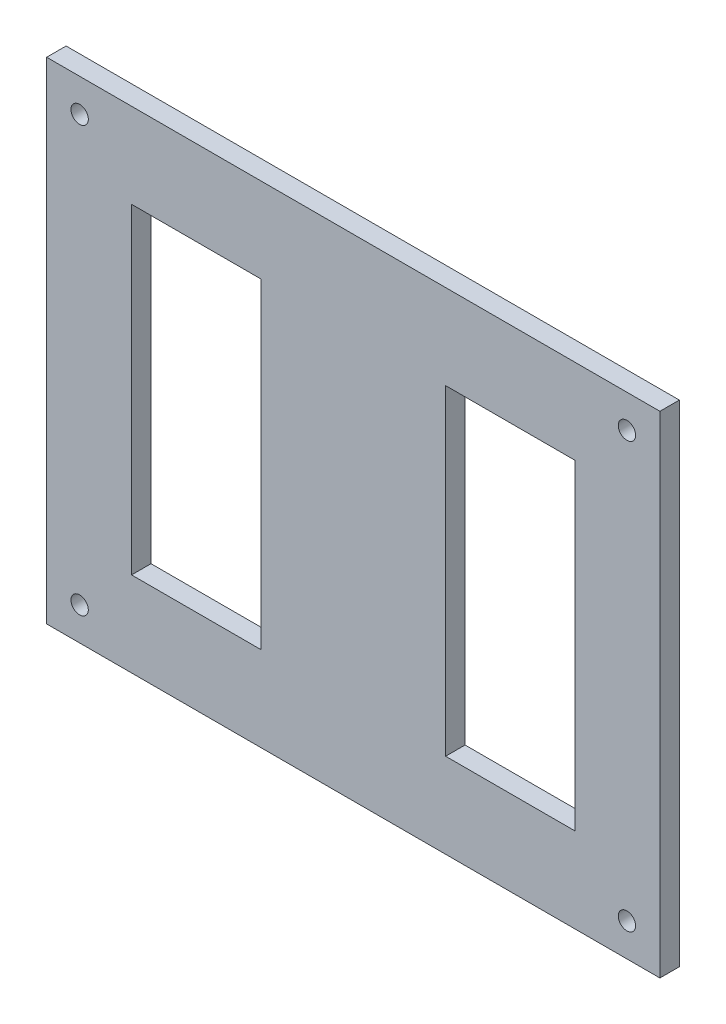
ISO-10303-21;
HEADER;
FILE_DESCRIPTION(('STEP AP214'),'2;1');
FILE_NAME('part.step','',(''),(''),'','','');
FILE_SCHEMA(('AUTOMOTIVE_DESIGN { 1 0 10303 214 1 1 1 1 }'));
ENDSEC;
DATA;
#1=APPLICATION_CONTEXT('core data for automotive mechanical design processes');
#2=APPLICATION_PROTOCOL_DEFINITION('international standard','automotive_design',2000,#1);
#3=PRODUCT_CONTEXT('',#1,'mechanical');
#4=PRODUCT('Part','Part','',(#3));
#5=PRODUCT_RELATED_PRODUCT_CATEGORY('part','',(#4));
#6=PRODUCT_DEFINITION_FORMATION('','',#4);
#7=PRODUCT_DEFINITION_CONTEXT('part definition',#1,'design');
#8=PRODUCT_DEFINITION('design','',#6,#7);
#9=PRODUCT_DEFINITION_SHAPE('','',#8);
#10=(LENGTH_UNIT() NAMED_UNIT(*) SI_UNIT(.MILLI.,.METRE.));
#11=(NAMED_UNIT(*) PLANE_ANGLE_UNIT() SI_UNIT($,.RADIAN.));
#12=(NAMED_UNIT(*) SI_UNIT($,.STERADIAN.) SOLID_ANGLE_UNIT());
#13=UNCERTAINTY_MEASURE_WITH_UNIT(LENGTH_MEASURE(1.E-05),#10,'distance_accuracy_value','');
#14=(GEOMETRIC_REPRESENTATION_CONTEXT(3) GLOBAL_UNCERTAINTY_ASSIGNED_CONTEXT((#13)) GLOBAL_UNIT_ASSIGNED_CONTEXT((#10,
#11,#12)) REPRESENTATION_CONTEXT('',''));
#15=CARTESIAN_POINT('',(0.,0.,0.));
#16=DIRECTION('',(0.,0.,1.));
#17=DIRECTION('',(1.,0.,0.));
#18=AXIS2_PLACEMENT_3D('',#15,#16,#17);
#19=CARTESIAN_POINT('',(0.,0.,3.175));
#20=DIRECTION('',(0.,0.,1.));
#21=DIRECTION('',(1.,0.,0.));
#22=AXIS2_PLACEMENT_3D('',#19,#20,#21);
#23=PLANE('',#22);
#24=DIRECTION('',(0.,1.,0.));
#25=VECTOR('',#24,1.);
#26=CARTESIAN_POINT('',(36.215,-26.215,3.175));
#27=LINE('',#26,#25);
#28=CARTESIAN_POINT('',(36.215,-26.215,3.175));
#29=VERTEX_POINT('',#28);
#30=CARTESIAN_POINT('',(36.215,26.215,3.175));
#31=VERTEX_POINT('',#30);
#32=EDGE_CURVE('E51',#29,#31,#27,.T.);
#33=ORIENTED_EDGE('',*,*,#32,.F.);
#34=DIRECTION('',(-1.,0.,0.));
#35=VECTOR('',#34,1.);
#36=CARTESIAN_POINT('',(36.215,-26.215,3.175));
#37=LINE('',#36,#35);
#38=CARTESIAN_POINT('',(15.085,-26.215,3.175));
#39=VERTEX_POINT('',#38);
#40=EDGE_CURVE('E148',#29,#39,#37,.T.);
#41=ORIENTED_EDGE('',*,*,#40,.T.);
#42=DIRECTION('',(0.,1.,0.));
#43=VECTOR('',#42,1.);
#44=CARTESIAN_POINT('',(15.085,-26.215,3.175));
#45=LINE('',#44,#43);
#46=CARTESIAN_POINT('',(15.085,26.215,3.175));
#47=VERTEX_POINT('',#46);
#48=EDGE_CURVE('E132',#39,#47,#45,.T.);
#49=ORIENTED_EDGE('',*,*,#48,.T.);
#50=DIRECTION('',(-1.,0.,0.));
#51=VECTOR('',#50,1.);
#52=CARTESIAN_POINT('',(36.215,26.215,3.175));
#53=LINE('',#52,#51);
#54=EDGE_CURVE('E142',#31,#47,#53,.T.);
#55=ORIENTED_EDGE('',*,*,#54,.F.);
#56=EDGE_LOOP('',(#33,#41,#49,#55));
#57=FACE_BOUND('',#56,.T.);
#58=CARTESIAN_POINT('',(-44.6966991411009,-34.6966991411009,3.175));
#59=DIRECTION('',(0.,0.,1.));
#60=DIRECTION('',(-1.,0.,0.));
#61=AXIS2_PLACEMENT_3D('',#58,#59,#60);
#62=CIRCLE('',#61,1.415);
#63=CARTESIAN_POINT('',(-46.1116991411009,-34.6966991411009,3.175));
#64=VERTEX_POINT('',#63);
#65=EDGE_CURVE('E155',#64,#64,#62,.T.);
#66=ORIENTED_EDGE('',*,*,#65,.F.);
#67=EDGE_LOOP('',(#66));
#68=FACE_BOUND('',#67,.T.);
#69=CARTESIAN_POINT('',(44.6966991411009,-34.6966991411009,3.175));
#70=DIRECTION('',(0.,0.,1.));
#71=DIRECTION('',(1.,0.,0.));
#72=AXIS2_PLACEMENT_3D('',#69,#70,#71);
#73=CIRCLE('',#72,1.415);
#74=CARTESIAN_POINT('',(46.1116991411009,-34.6966991411009,3.175));
#75=VERTEX_POINT('',#74);
#76=EDGE_CURVE('E186',#75,#75,#73,.T.);
#77=ORIENTED_EDGE('',*,*,#76,.F.);
#78=EDGE_LOOP('',(#77));
#79=FACE_BOUND('',#78,.T.);
#80=CARTESIAN_POINT('',(44.6966991411009,34.6966991411009,3.175));
#81=DIRECTION('',(0.,0.,1.));
#82=DIRECTION('',(-1.,0.,0.));
#83=AXIS2_PLACEMENT_3D('',#80,#81,#82);
#84=CIRCLE('',#83,1.415);
#85=CARTESIAN_POINT('',(43.2816991411009,34.6966991411009,3.175));
#86=VERTEX_POINT('',#85);
#87=EDGE_CURVE('E180',#86,#86,#84,.T.);
#88=ORIENTED_EDGE('',*,*,#87,.F.);
#89=EDGE_LOOP('',(#88));
#90=FACE_BOUND('',#89,.T.);
#91=CARTESIAN_POINT('',(-44.6966991411009,34.6966991411009,3.175));
#92=DIRECTION('',(0.,0.,1.));
#93=DIRECTION('',(1.,0.,0.));
#94=AXIS2_PLACEMENT_3D('',#91,#92,#93);
#95=CIRCLE('',#94,1.415);
#96=CARTESIAN_POINT('',(-43.2816991411009,34.6966991411009,3.175));
#97=VERTEX_POINT('',#96);
#98=EDGE_CURVE('E179',#97,#97,#95,.T.);
#99=ORIENTED_EDGE('',*,*,#98,.F.);
#100=EDGE_LOOP('',(#99));
#101=FACE_BOUND('',#100,.T.);
#102=DIRECTION('',(0.,1.,0.));
#103=VECTOR('',#102,1.);
#104=CARTESIAN_POINT('',(50.085,40.085,3.175));
#105=LINE('',#104,#103);
#106=CARTESIAN_POINT('',(50.085,-40.085,3.175));
#107=VERTEX_POINT('',#106);
#108=CARTESIAN_POINT('',(50.085,40.085,3.175));
#109=VERTEX_POINT('',#108);
#110=EDGE_CURVE('E200',#107,#109,#105,.T.);
#111=ORIENTED_EDGE('',*,*,#110,.T.);
#112=DIRECTION('',(-1.,0.,0.));
#113=VECTOR('',#112,1.);
#114=CARTESIAN_POINT('',(-50.085,40.085,3.175));
#115=LINE('',#114,#113);
#116=CARTESIAN_POINT('',(-50.085,40.085,3.175));
#117=VERTEX_POINT('',#116);
#118=EDGE_CURVE('E203',#109,#117,#115,.T.);
#119=ORIENTED_EDGE('',*,*,#118,.T.);
#120=DIRECTION('',(0.,-1.,0.));
#121=VECTOR('',#120,1.);
#122=CARTESIAN_POINT('',(-50.085,40.085,3.175));
#123=LINE('',#122,#121);
#124=CARTESIAN_POINT('',(-50.085,-40.085,3.175));
#125=VERTEX_POINT('',#124);
#126=EDGE_CURVE('E206',#117,#125,#123,.T.);
#127=ORIENTED_EDGE('',*,*,#126,.T.);
#128=DIRECTION('',(1.,0.,0.));
#129=VECTOR('',#128,1.);
#130=CARTESIAN_POINT('',(-50.085,-40.085,3.175));
#131=LINE('',#130,#129);
#132=EDGE_CURVE('E208',#125,#107,#131,.T.);
#133=ORIENTED_EDGE('',*,*,#132,.T.);
#134=EDGE_LOOP('',(#111,#119,#127,#133));
#135=FACE_BOUND('',#134,.T.);
#136=DIRECTION('',(1.,0.,0.));
#137=VECTOR('',#136,1.);
#138=CARTESIAN_POINT('',(-36.215,-26.215,3.175));
#139=LINE('',#138,#137);
#140=CARTESIAN_POINT('',(-36.215,-26.215,3.175));
#141=VERTEX_POINT('',#140);
#142=CARTESIAN_POINT('',(-15.085,-26.215,3.175));
#143=VERTEX_POINT('',#142);
#144=EDGE_CURVE('E166',#141,#143,#139,.T.);
#145=ORIENTED_EDGE('',*,*,#144,.F.);
#146=DIRECTION('',(0.,1.,0.));
#147=VECTOR('',#146,1.);
#148=CARTESIAN_POINT('',(-36.215,-26.215,3.175));
#149=LINE('',#148,#147);
#150=CARTESIAN_POINT('',(-36.215,26.215,3.175));
#151=VERTEX_POINT('',#150);
#152=EDGE_CURVE('E59',#141,#151,#149,.T.);
#153=ORIENTED_EDGE('',*,*,#152,.T.);
#154=DIRECTION('',(1.,0.,0.));
#155=VECTOR('',#154,1.);
#156=CARTESIAN_POINT('',(-36.215,26.215,3.175));
#157=LINE('',#156,#155);
#158=CARTESIAN_POINT('',(-15.085,26.215,3.175));
#159=VERTEX_POINT('',#158);
#160=EDGE_CURVE('E172',#151,#159,#157,.T.);
#161=ORIENTED_EDGE('',*,*,#160,.T.);
#162=DIRECTION('',(0.,1.,0.));
#163=VECTOR('',#162,1.);
#164=CARTESIAN_POINT('',(-15.085,-26.215,3.175));
#165=LINE('',#164,#163);
#166=EDGE_CURVE('E169',#143,#159,#165,.T.);
#167=ORIENTED_EDGE('',*,*,#166,.F.);
#168=EDGE_LOOP('',(#145,#153,#161,#167));
#169=FACE_BOUND('',#168,.T.);
#170=ADVANCED_FACE('F36',(#57,#68,#79,#90,#101,#135,#169),#23,.T.);
#171=CARTESIAN_POINT('',(0.,0.,0.));
#172=DIRECTION('',(0.,0.,1.));
#173=DIRECTION('',(1.,0.,0.));
#174=AXIS2_PLACEMENT_3D('',#171,#172,#173);
#175=PLANE('',#174);
#176=DIRECTION('',(-1.,0.,0.));
#177=VECTOR('',#176,1.);
#178=CARTESIAN_POINT('',(0.,-26.215,0.));
#179=LINE('',#178,#177);
#180=CARTESIAN_POINT('',(36.215,-26.215,0.));
#181=VERTEX_POINT('',#180);
#182=CARTESIAN_POINT('',(15.085,-26.215,0.));
#183=VERTEX_POINT('',#182);
#184=EDGE_CURVE('E44',#181,#183,#179,.T.);
#185=ORIENTED_EDGE('',*,*,#184,.F.);
#186=DIRECTION('',(0.,1.,0.));
#187=VECTOR('',#186,1.);
#188=CARTESIAN_POINT('',(36.215,0.,0.));
#189=LINE('',#188,#187);
#190=CARTESIAN_POINT('',(36.215,26.215,0.));
#191=VERTEX_POINT('',#190);
#192=EDGE_CURVE('E11',#181,#191,#189,.T.);
#193=ORIENTED_EDGE('',*,*,#192,.T.);
#194=DIRECTION('',(-1.,0.,0.));
#195=VECTOR('',#194,1.);
#196=CARTESIAN_POINT('',(0.,26.215,0.));
#197=LINE('',#196,#195);
#198=CARTESIAN_POINT('',(15.085,26.215,0.));
#199=VERTEX_POINT('',#198);
#200=EDGE_CURVE('E239',#191,#199,#197,.T.);
#201=ORIENTED_EDGE('',*,*,#200,.T.);
#202=DIRECTION('',(0.,1.,0.));
#203=VECTOR('',#202,1.);
#204=CARTESIAN_POINT('',(15.085,0.,0.));
#205=LINE('',#204,#203);
#206=EDGE_CURVE('E135',#183,#199,#205,.T.);
#207=ORIENTED_EDGE('',*,*,#206,.F.);
#208=EDGE_LOOP('',(#185,#193,#201,#207));
#209=FACE_BOUND('',#208,.T.);
#210=DIRECTION('',(0.,1.,0.));
#211=VECTOR('',#210,1.);
#212=CARTESIAN_POINT('',(50.085,40.085,0.));
#213=LINE('',#212,#211);
#214=CARTESIAN_POINT('',(50.085,-40.085,0.));
#215=VERTEX_POINT('',#214);
#216=CARTESIAN_POINT('',(50.085,40.085,0.));
#217=VERTEX_POINT('',#216);
#218=EDGE_CURVE('E197',#215,#217,#213,.T.);
#219=ORIENTED_EDGE('',*,*,#218,.F.);
#220=DIRECTION('',(1.,0.,0.));
#221=VECTOR('',#220,1.);
#222=CARTESIAN_POINT('',(-50.085,-40.085,0.));
#223=LINE('',#222,#221);
#224=CARTESIAN_POINT('',(-50.085,-40.085,0.));
#225=VERTEX_POINT('',#224);
#226=EDGE_CURVE('E204',#225,#215,#223,.T.);
#227=ORIENTED_EDGE('',*,*,#226,.F.);
#228=DIRECTION('',(0.,-1.,0.));
#229=VECTOR('',#228,1.);
#230=CARTESIAN_POINT('',(-50.085,40.085,0.));
#231=LINE('',#230,#229);
#232=CARTESIAN_POINT('',(-50.085,40.085,0.));
#233=VERTEX_POINT('',#232);
#234=EDGE_CURVE('E215',#233,#225,#231,.T.);
#235=ORIENTED_EDGE('',*,*,#234,.F.);
#236=DIRECTION('',(-1.,0.,0.));
#237=VECTOR('',#236,1.);
#238=CARTESIAN_POINT('',(-50.085,40.085,0.));
#239=LINE('',#238,#237);
#240=EDGE_CURVE('E213',#217,#233,#239,.T.);
#241=ORIENTED_EDGE('',*,*,#240,.F.);
#242=EDGE_LOOP('',(#219,#227,#235,#241));
#243=FACE_BOUND('',#242,.T.);
#244=CARTESIAN_POINT('',(-44.6966991411009,34.6966991411009,0.));
#245=DIRECTION('',(0.,0.,1.));
#246=DIRECTION('',(1.,0.,0.));
#247=AXIS2_PLACEMENT_3D('',#244,#245,#246);
#248=CIRCLE('',#247,1.415);
#249=CARTESIAN_POINT('',(-43.2816991411009,34.6966991411009,0.));
#250=VERTEX_POINT('',#249);
#251=EDGE_CURVE('E194',#250,#250,#248,.T.);
#252=ORIENTED_EDGE('',*,*,#251,.T.);
#253=EDGE_LOOP('',(#252));
#254=FACE_BOUND('',#253,.T.);
#255=CARTESIAN_POINT('',(44.6966991411009,34.6966991411009,0.));
#256=DIRECTION('',(0.,0.,1.));
#257=DIRECTION('',(-1.,0.,0.));
#258=AXIS2_PLACEMENT_3D('',#255,#256,#257);
#259=CIRCLE('',#258,1.415);
#260=CARTESIAN_POINT('',(43.2816991411009,34.6966991411009,0.));
#261=VERTEX_POINT('',#260);
#262=EDGE_CURVE('E176',#261,#261,#259,.T.);
#263=ORIENTED_EDGE('',*,*,#262,.T.);
#264=EDGE_LOOP('',(#263));
#265=FACE_BOUND('',#264,.T.);
#266=CARTESIAN_POINT('',(44.6966991411009,-34.6966991411009,0.));
#267=DIRECTION('',(0.,0.,1.));
#268=DIRECTION('',(1.,0.,0.));
#269=AXIS2_PLACEMENT_3D('',#266,#267,#268);
#270=CIRCLE('',#269,1.415);
#271=CARTESIAN_POINT('',(46.1116991411009,-34.6966991411009,0.));
#272=VERTEX_POINT('',#271);
#273=EDGE_CURVE('E183',#272,#272,#270,.T.);
#274=ORIENTED_EDGE('',*,*,#273,.T.);
#275=EDGE_LOOP('',(#274));
#276=FACE_BOUND('',#275,.T.);
#277=CARTESIAN_POINT('',(-44.6966991411009,-34.6966991411009,0.));
#278=DIRECTION('',(0.,0.,1.));
#279=DIRECTION('',(-1.,0.,0.));
#280=AXIS2_PLACEMENT_3D('',#277,#278,#279);
#281=CIRCLE('',#280,1.415);
#282=CARTESIAN_POINT('',(-46.1116991411009,-34.6966991411009,0.));
#283=VERTEX_POINT('',#282);
#284=EDGE_CURVE('E189',#283,#283,#281,.T.);
#285=ORIENTED_EDGE('',*,*,#284,.T.);
#286=EDGE_LOOP('',(#285));
#287=FACE_BOUND('',#286,.T.);
#288=DIRECTION('',(0.,1.,0.));
#289=VECTOR('',#288,1.);
#290=CARTESIAN_POINT('',(-36.215,0.,0.));
#291=LINE('',#290,#289);
#292=CARTESIAN_POINT('',(-36.215,-26.215,0.));
#293=VERTEX_POINT('',#292);
#294=CARTESIAN_POINT('',(-36.215,26.215,0.));
#295=VERTEX_POINT('',#294);
#296=EDGE_CURVE('E237',#293,#295,#291,.T.);
#297=ORIENTED_EDGE('',*,*,#296,.F.);
#298=DIRECTION('',(1.,0.,0.));
#299=VECTOR('',#298,1.);
#300=CARTESIAN_POINT('',(0.,-26.215,0.));
#301=LINE('',#300,#299);
#302=CARTESIAN_POINT('',(-15.085,-26.215,0.));
#303=VERTEX_POINT('',#302);
#304=EDGE_CURVE('E229',#293,#303,#301,.T.);
#305=ORIENTED_EDGE('',*,*,#304,.T.);
#306=DIRECTION('',(0.,1.,0.));
#307=VECTOR('',#306,1.);
#308=CARTESIAN_POINT('',(-15.085,0.,0.));
#309=LINE('',#308,#307);
#310=CARTESIAN_POINT('',(-15.085,26.215,0.));
#311=VERTEX_POINT('',#310);
#312=EDGE_CURVE('E232',#303,#311,#309,.T.);
#313=ORIENTED_EDGE('',*,*,#312,.T.);
#314=DIRECTION('',(1.,0.,0.));
#315=VECTOR('',#314,1.);
#316=CARTESIAN_POINT('',(0.,26.215,0.));
#317=LINE('',#316,#315);
#318=EDGE_CURVE('E235',#295,#311,#317,.T.);
#319=ORIENTED_EDGE('',*,*,#318,.F.);
#320=EDGE_LOOP('',(#297,#305,#313,#319));
#321=FACE_BOUND('',#320,.T.);
#322=ADVANCED_FACE('F246',(#209,#243,#254,#265,#276,#287,#321),#175,.F.);
#323=CARTESIAN_POINT('',(50.085,40.085,3.175));
#324=DIRECTION('',(-1.,0.,0.));
#325=DIRECTION('',(0.,0.,1.));
#326=AXIS2_PLACEMENT_3D('',#323,#324,#325);
#327=PLANE('',#326);
#328=ORIENTED_EDGE('',*,*,#218,.T.);
#329=DIRECTION('',(0.,0.,-1.));
#330=VECTOR('',#329,1.);
#331=CARTESIAN_POINT('',(50.085,40.085,3.175));
#332=LINE('',#331,#330);
#333=EDGE_CURVE('E226',#109,#217,#332,.T.);
#334=ORIENTED_EDGE('',*,*,#333,.F.);
#335=ORIENTED_EDGE('',*,*,#110,.F.);
#336=DIRECTION('',(0.,0.,-1.));
#337=VECTOR('',#336,1.);
#338=CARTESIAN_POINT('',(50.085,-40.085,3.175));
#339=LINE('',#338,#337);
#340=EDGE_CURVE('E210',#107,#215,#339,.T.);
#341=ORIENTED_EDGE('',*,*,#340,.T.);
#342=EDGE_LOOP('',(#328,#334,#335,#341));
#343=FACE_BOUND('',#342,.T.);
#344=ADVANCED_FACE('F38',(#343),#327,.F.);
#345=CARTESIAN_POINT('',(-50.085,40.085,3.175));
#346=DIRECTION('',(0.,-1.,0.));
#347=DIRECTION('',(0.,0.,-1.));
#348=AXIS2_PLACEMENT_3D('',#345,#346,#347);
#349=PLANE('',#348);
#350=ORIENTED_EDGE('',*,*,#240,.T.);
#351=DIRECTION('',(0.,0.,-1.));
#352=VECTOR('',#351,1.);
#353=CARTESIAN_POINT('',(-50.085,40.085,3.175));
#354=LINE('',#353,#352);
#355=EDGE_CURVE('E223',#117,#233,#354,.T.);
#356=ORIENTED_EDGE('',*,*,#355,.F.);
#357=ORIENTED_EDGE('',*,*,#118,.F.);
#358=ORIENTED_EDGE('',*,*,#333,.T.);
#359=EDGE_LOOP('',(#350,#356,#357,#358));
#360=FACE_BOUND('',#359,.T.);
#361=ADVANCED_FACE('F278',(#360),#349,.F.);
#362=CARTESIAN_POINT('',(-50.085,40.085,3.175));
#363=DIRECTION('',(1.,0.,0.));
#364=DIRECTION('',(0.,1.,0.));
#365=AXIS2_PLACEMENT_3D('',#362,#363,#364);
#366=PLANE('',#365);
#367=ORIENTED_EDGE('',*,*,#234,.T.);
#368=DIRECTION('',(0.,0.,-1.));
#369=VECTOR('',#368,1.);
#370=CARTESIAN_POINT('',(-50.085,-40.085,3.175));
#371=LINE('',#370,#369);
#372=EDGE_CURVE('E220',#125,#225,#371,.T.);
#373=ORIENTED_EDGE('',*,*,#372,.F.);
#374=ORIENTED_EDGE('',*,*,#126,.F.);
#375=ORIENTED_EDGE('',*,*,#355,.T.);
#376=EDGE_LOOP('',(#367,#373,#374,#375));
#377=FACE_BOUND('',#376,.T.);
#378=ADVANCED_FACE('F275',(#377),#366,.F.);
#379=CARTESIAN_POINT('',(-50.085,-40.085,3.175));
#380=DIRECTION('',(0.,1.,0.));
#381=DIRECTION('',(0.,0.,1.));
#382=AXIS2_PLACEMENT_3D('',#379,#380,#381);
#383=PLANE('',#382);
#384=ORIENTED_EDGE('',*,*,#226,.T.);
#385=ORIENTED_EDGE('',*,*,#340,.F.);
#386=ORIENTED_EDGE('',*,*,#132,.F.);
#387=ORIENTED_EDGE('',*,*,#372,.T.);
#388=EDGE_LOOP('',(#384,#385,#386,#387));
#389=FACE_BOUND('',#388,.T.);
#390=ADVANCED_FACE('F272',(#389),#383,.F.);
#391=CARTESIAN_POINT('',(-44.6966991411009,34.6966991411009,0.));
#392=DIRECTION('',(0.,0.,1.));
#393=DIRECTION('',(1.,0.,0.));
#394=AXIS2_PLACEMENT_3D('',#391,#392,#393);
#395=CYLINDRICAL_SURFACE('',#394,1.415);
#396=ORIENTED_EDGE('',*,*,#251,.F.);
#397=EDGE_LOOP('',(#396));
#398=FACE_BOUND('',#397,.T.);
#399=ORIENTED_EDGE('',*,*,#98,.T.);
#400=EDGE_LOOP('',(#399));
#401=FACE_BOUND('',#400,.T.);
#402=ADVANCED_FACE('F269',(#398,#401),#395,.F.);
#403=CARTESIAN_POINT('',(44.6966991411009,34.6966991411009,0.));
#404=DIRECTION('',(0.,0.,1.));
#405=DIRECTION('',(1.,0.,0.));
#406=AXIS2_PLACEMENT_3D('',#403,#404,#405);
#407=CYLINDRICAL_SURFACE('',#406,1.415);
#408=ORIENTED_EDGE('',*,*,#262,.F.);
#409=EDGE_LOOP('',(#408));
#410=FACE_BOUND('',#409,.T.);
#411=ORIENTED_EDGE('',*,*,#87,.T.);
#412=EDGE_LOOP('',(#411));
#413=FACE_BOUND('',#412,.T.);
#414=ADVANCED_FACE('F319',(#410,#413),#407,.F.);
#415=CARTESIAN_POINT('',(44.6966991411009,-34.6966991411009,0.));
#416=DIRECTION('',(0.,0.,1.));
#417=DIRECTION('',(1.,0.,0.));
#418=AXIS2_PLACEMENT_3D('',#415,#416,#417);
#419=CYLINDRICAL_SURFACE('',#418,1.415);
#420=ORIENTED_EDGE('',*,*,#273,.F.);
#421=EDGE_LOOP('',(#420));
#422=FACE_BOUND('',#421,.T.);
#423=ORIENTED_EDGE('',*,*,#76,.T.);
#424=EDGE_LOOP('',(#423));
#425=FACE_BOUND('',#424,.T.);
#426=ADVANCED_FACE('F322',(#422,#425),#419,.F.);
#427=CARTESIAN_POINT('',(-44.6966991411009,-34.6966991411009,0.));
#428=DIRECTION('',(0.,0.,1.));
#429=DIRECTION('',(1.,0.,0.));
#430=AXIS2_PLACEMENT_3D('',#427,#428,#429);
#431=CYLINDRICAL_SURFACE('',#430,1.415);
#432=ORIENTED_EDGE('',*,*,#284,.F.);
#433=EDGE_LOOP('',(#432));
#434=FACE_BOUND('',#433,.T.);
#435=ORIENTED_EDGE('',*,*,#65,.T.);
#436=EDGE_LOOP('',(#435));
#437=FACE_BOUND('',#436,.T.);
#438=ADVANCED_FACE('F325',(#434,#437),#431,.F.);
#439=CARTESIAN_POINT('',(-36.215,-26.215,-6.825));
#440=DIRECTION('',(1.,0.,0.));
#441=DIRECTION('',(0.,0.,-1.));
#442=AXIS2_PLACEMENT_3D('',#439,#440,#441);
#443=PLANE('',#442);
#444=ORIENTED_EDGE('',*,*,#296,.T.);
#445=DIRECTION('',(0.,0.,1.));
#446=VECTOR('',#445,1.);
#447=CARTESIAN_POINT('',(-36.215,26.215,-6.825));
#448=LINE('',#447,#446);
#449=EDGE_CURVE('E158',#295,#151,#448,.T.);
#450=ORIENTED_EDGE('',*,*,#449,.T.);
#451=ORIENTED_EDGE('',*,*,#152,.F.);
#452=DIRECTION('',(0.,0.,1.));
#453=VECTOR('',#452,1.);
#454=CARTESIAN_POINT('',(-36.215,-26.215,-6.825));
#455=LINE('',#454,#453);
#456=EDGE_CURVE('E164',#293,#141,#455,.T.);
#457=ORIENTED_EDGE('',*,*,#456,.F.);
#458=EDGE_LOOP('',(#444,#450,#451,#457));
#459=FACE_BOUND('',#458,.T.);
#460=ADVANCED_FACE('F303',(#459),#443,.T.);
#461=CARTESIAN_POINT('',(-36.215,26.215,-6.825));
#462=DIRECTION('',(0.,-1.,0.));
#463=DIRECTION('',(0.,0.,-1.));
#464=AXIS2_PLACEMENT_3D('',#461,#462,#463);
#465=PLANE('',#464);
#466=ORIENTED_EDGE('',*,*,#318,.T.);
#467=DIRECTION('',(0.,0.,1.));
#468=VECTOR('',#467,1.);
#469=CARTESIAN_POINT('',(-15.085,26.215,-6.825));
#470=LINE('',#469,#468);
#471=EDGE_CURVE('E160',#311,#159,#470,.T.);
#472=ORIENTED_EDGE('',*,*,#471,.T.);
#473=ORIENTED_EDGE('',*,*,#160,.F.);
#474=ORIENTED_EDGE('',*,*,#449,.F.);
#475=EDGE_LOOP('',(#466,#472,#473,#474));
#476=FACE_BOUND('',#475,.T.);
#477=ADVANCED_FACE('F309',(#476),#465,.T.);
#478=CARTESIAN_POINT('',(-15.085,-26.215,-6.825));
#479=DIRECTION('',(1.,0.,0.));
#480=DIRECTION('',(0.,1.,0.));
#481=AXIS2_PLACEMENT_3D('',#478,#479,#480);
#482=PLANE('',#481);
#483=DIRECTION('',(0.,0.,1.));
#484=VECTOR('',#483,1.);
#485=CARTESIAN_POINT('',(-15.085,-26.215,-6.825));
#486=LINE('',#485,#484);
#487=EDGE_CURVE('E162',#303,#143,#486,.T.);
#488=ORIENTED_EDGE('',*,*,#487,.T.);
#489=ORIENTED_EDGE('',*,*,#166,.T.);
#490=ORIENTED_EDGE('',*,*,#471,.F.);
#491=ORIENTED_EDGE('',*,*,#312,.F.);
#492=EDGE_LOOP('',(#488,#489,#490,#491));
#493=FACE_BOUND('',#492,.T.);
#494=ADVANCED_FACE('F257',(#493),#482,.F.);
#495=CARTESIAN_POINT('',(-36.215,-26.215,-6.825));
#496=DIRECTION('',(0.,-1.,0.));
#497=DIRECTION('',(0.,0.,-1.));
#498=AXIS2_PLACEMENT_3D('',#495,#496,#497);
#499=PLANE('',#498);
#500=ORIENTED_EDGE('',*,*,#456,.T.);
#501=ORIENTED_EDGE('',*,*,#144,.T.);
#502=ORIENTED_EDGE('',*,*,#487,.F.);
#503=ORIENTED_EDGE('',*,*,#304,.F.);
#504=EDGE_LOOP('',(#500,#501,#502,#503));
#505=FACE_BOUND('',#504,.T.);
#506=ADVANCED_FACE('F250',(#505),#499,.F.);
#507=CARTESIAN_POINT('',(36.215,-26.215,-6.825));
#508=DIRECTION('',(1.,0.,0.));
#509=DIRECTION('',(0.,0.,-1.));
#510=AXIS2_PLACEMENT_3D('',#507,#508,#509);
#511=PLANE('',#510);
#512=DIRECTION('',(0.,0.,1.));
#513=VECTOR('',#512,1.);
#514=CARTESIAN_POINT('',(36.215,-26.215,-6.825));
#515=LINE('',#514,#513);
#516=EDGE_CURVE('E153',#181,#29,#515,.T.);
#517=ORIENTED_EDGE('',*,*,#516,.T.);
#518=ORIENTED_EDGE('',*,*,#32,.T.);
#519=DIRECTION('',(0.,0.,1.));
#520=VECTOR('',#519,1.);
#521=CARTESIAN_POINT('',(36.215,26.215,-6.825));
#522=LINE('',#521,#520);
#523=EDGE_CURVE('E139',#191,#31,#522,.T.);
#524=ORIENTED_EDGE('',*,*,#523,.F.);
#525=ORIENTED_EDGE('',*,*,#192,.F.);
#526=EDGE_LOOP('',(#517,#518,#524,#525));
#527=FACE_BOUND('',#526,.T.);
#528=ADVANCED_FACE('F248',(#527),#511,.F.);
#529=CARTESIAN_POINT('',(36.215,-26.215,-6.825));
#530=DIRECTION('',(0.,1.,0.));
#531=DIRECTION('',(0.,0.,1.));
#532=AXIS2_PLACEMENT_3D('',#529,#530,#531);
#533=PLANE('',#532);
#534=ORIENTED_EDGE('',*,*,#184,.T.);
#535=DIRECTION('',(0.,0.,1.));
#536=VECTOR('',#535,1.);
#537=CARTESIAN_POINT('',(15.085,-26.215,-6.825));
#538=LINE('',#537,#536);
#539=EDGE_CURVE('E138',#183,#39,#538,.T.);
#540=ORIENTED_EDGE('',*,*,#539,.T.);
#541=ORIENTED_EDGE('',*,*,#40,.F.);
#542=ORIENTED_EDGE('',*,*,#516,.F.);
#543=EDGE_LOOP('',(#534,#540,#541,#542));
#544=FACE_BOUND('',#543,.T.);
#545=ADVANCED_FACE('F244',(#544),#533,.T.);
#546=CARTESIAN_POINT('',(15.085,-26.215,-6.825));
#547=DIRECTION('',(1.,0.,0.));
#548=DIRECTION('',(0.,1.,0.));
#549=AXIS2_PLACEMENT_3D('',#546,#547,#548);
#550=PLANE('',#549);
#551=ORIENTED_EDGE('',*,*,#206,.T.);
#552=DIRECTION('',(0.,0.,1.));
#553=VECTOR('',#552,1.);
#554=CARTESIAN_POINT('',(15.085,26.215,-6.825));
#555=LINE('',#554,#553);
#556=EDGE_CURVE('E127',#199,#47,#555,.T.);
#557=ORIENTED_EDGE('',*,*,#556,.T.);
#558=ORIENTED_EDGE('',*,*,#48,.F.);
#559=ORIENTED_EDGE('',*,*,#539,.F.);
#560=EDGE_LOOP('',(#551,#557,#558,#559));
#561=FACE_BOUND('',#560,.T.);
#562=ADVANCED_FACE('F129',(#561),#550,.T.);
#563=CARTESIAN_POINT('',(36.215,26.215,-6.825));
#564=DIRECTION('',(0.,1.,0.));
#565=DIRECTION('',(0.,0.,1.));
#566=AXIS2_PLACEMENT_3D('',#563,#564,#565);
#567=PLANE('',#566);
#568=ORIENTED_EDGE('',*,*,#523,.T.);
#569=ORIENTED_EDGE('',*,*,#54,.T.);
#570=ORIENTED_EDGE('',*,*,#556,.F.);
#571=ORIENTED_EDGE('',*,*,#200,.F.);
#572=EDGE_LOOP('',(#568,#569,#570,#571));
#573=FACE_BOUND('',#572,.T.);
#574=ADVANCED_FACE('F143',(#573),#567,.F.);
#575=CLOSED_SHELL('',(#170,#322,#344,#361,#378,#390,#402,#414,#426,#438,#460,#477,#494,#506,
#528,#545,#562,#574));
#576=MANIFOLD_SOLID_BREP('B2',#575);
#577=ADVANCED_BREP_SHAPE_REPRESENTATION('',(#18,#576),#14);
#578=SHAPE_DEFINITION_REPRESENTATION(#9,#577);
ENDSEC;
END-ISO-10303-21;
